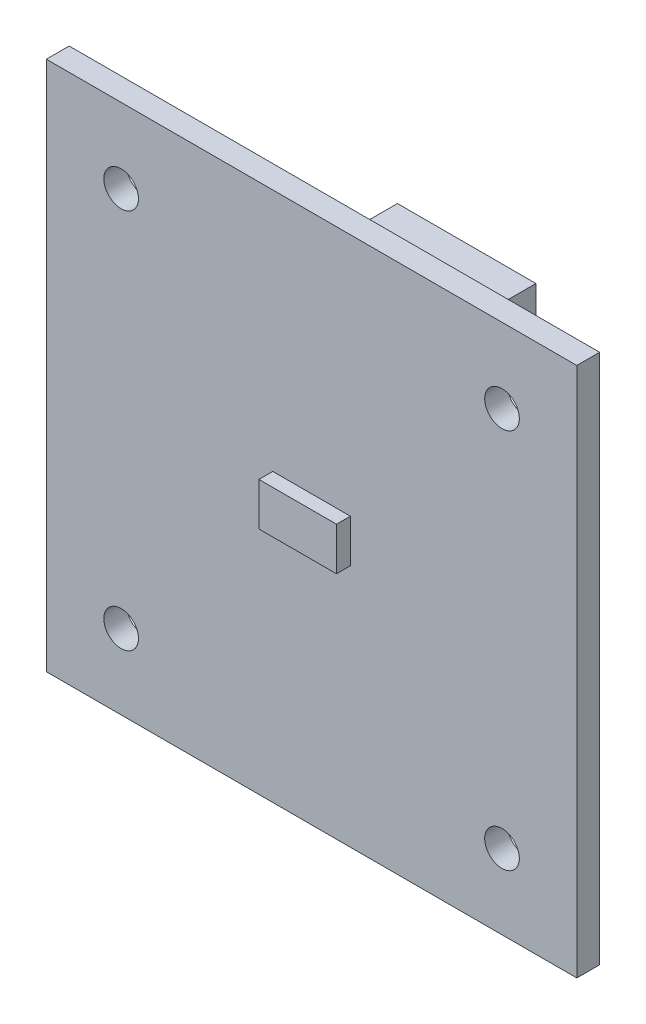
ISO-10303-21;
HEADER;
FILE_DESCRIPTION(('STEP AP214'),'2;1');
FILE_NAME('part.step','',(''),(''),'','','');
FILE_SCHEMA(('AUTOMOTIVE_DESIGN { 1 0 10303 214 1 1 1 1 }'));
ENDSEC;
DATA;
#1=APPLICATION_CONTEXT('core data for automotive mechanical design processes');
#2=APPLICATION_PROTOCOL_DEFINITION('international standard','automotive_design',2000,#1);
#3=PRODUCT_CONTEXT('',#1,'mechanical');
#4=PRODUCT('Part','Part','',(#3));
#5=PRODUCT_RELATED_PRODUCT_CATEGORY('part','',(#4));
#6=PRODUCT_DEFINITION_FORMATION('','',#4);
#7=PRODUCT_DEFINITION_CONTEXT('part definition',#1,'design');
#8=PRODUCT_DEFINITION('design','',#6,#7);
#9=PRODUCT_DEFINITION_SHAPE('','',#8);
#10=(LENGTH_UNIT() NAMED_UNIT(*) SI_UNIT(.MILLI.,.METRE.));
#11=(NAMED_UNIT(*) PLANE_ANGLE_UNIT() SI_UNIT($,.RADIAN.));
#12=(NAMED_UNIT(*) SI_UNIT($,.STERADIAN.) SOLID_ANGLE_UNIT());
#13=UNCERTAINTY_MEASURE_WITH_UNIT(LENGTH_MEASURE(1.E-05),#10,'distance_accuracy_value','');
#14=(GEOMETRIC_REPRESENTATION_CONTEXT(3) GLOBAL_UNCERTAINTY_ASSIGNED_CONTEXT((#13)) GLOBAL_UNIT_ASSIGNED_CONTEXT((#10,
#11,#12)) REPRESENTATION_CONTEXT('',''));
#15=CARTESIAN_POINT('',(0.,0.,0.));
#16=DIRECTION('',(0.,0.,1.));
#17=DIRECTION('',(1.,0.,0.));
#18=AXIS2_PLACEMENT_3D('',#15,#16,#17);
#19=CARTESIAN_POINT('',(0.,0.,0.));
#20=DIRECTION('',(0.,0.,-1.));
#21=DIRECTION('',(-1.,0.,0.));
#22=AXIS2_PLACEMENT_3D('',#19,#20,#21);
#23=PLANE('',#22);
#24=CARTESIAN_POINT('',(13.75,-13.75,0.));
#25=DIRECTION('',(0.,0.,1.));
#26=DIRECTION('',(1.,0.,0.));
#27=AXIS2_PLACEMENT_3D('',#24,#25,#26);
#28=CIRCLE('',#27,1.25);
#29=CARTESIAN_POINT('',(15.,-13.75,0.));
#30=VERTEX_POINT('',#29);
#31=EDGE_CURVE('E197',#30,#30,#28,.T.);
#32=ORIENTED_EDGE('',*,*,#31,.T.);
#33=EDGE_LOOP('',(#32));
#34=FACE_BOUND('',#33,.T.);
#35=CARTESIAN_POINT('',(-13.75,13.75,0.));
#36=DIRECTION('',(0.,0.,1.));
#37=DIRECTION('',(1.,0.,0.));
#38=AXIS2_PLACEMENT_3D('',#35,#36,#37);
#39=CIRCLE('',#38,1.25);
#40=CARTESIAN_POINT('',(-12.5,13.75,0.));
#41=VERTEX_POINT('',#40);
#42=EDGE_CURVE('E209',#41,#41,#39,.T.);
#43=ORIENTED_EDGE('',*,*,#42,.T.);
#44=EDGE_LOOP('',(#43));
#45=FACE_BOUND('',#44,.T.);
#46=DIRECTION('',(0.,1.,0.));
#47=VECTOR('',#46,1.);
#48=CARTESIAN_POINT('',(19.15,-19.15,0.));
#49=LINE('',#48,#47);
#50=CARTESIAN_POINT('',(19.15,-19.15,0.));
#51=VERTEX_POINT('',#50);
#52=CARTESIAN_POINT('',(19.15,19.15,0.));
#53=VERTEX_POINT('',#52);
#54=EDGE_CURVE('E215',#51,#53,#49,.T.);
#55=ORIENTED_EDGE('',*,*,#54,.F.);
#56=DIRECTION('',(1.,0.,0.));
#57=VECTOR('',#56,1.);
#58=CARTESIAN_POINT('',(-19.15,-19.15,0.));
#59=LINE('',#58,#57);
#60=CARTESIAN_POINT('',(-19.15,-19.15,0.));
#61=VERTEX_POINT('',#60);
#62=EDGE_CURVE('E222',#61,#51,#59,.T.);
#63=ORIENTED_EDGE('',*,*,#62,.F.);
#64=DIRECTION('',(0.,-1.,0.));
#65=VECTOR('',#64,1.);
#66=CARTESIAN_POINT('',(-19.15,-19.15,0.));
#67=LINE('',#66,#65);
#68=CARTESIAN_POINT('',(-19.15,19.15,0.));
#69=VERTEX_POINT('',#68);
#70=EDGE_CURVE('E237',#69,#61,#67,.T.);
#71=ORIENTED_EDGE('',*,*,#70,.F.);
#72=DIRECTION('',(-1.,0.,0.));
#73=VECTOR('',#72,1.);
#74=CARTESIAN_POINT('',(-19.15,19.15,0.));
#75=LINE('',#74,#73);
#76=EDGE_CURVE('E234',#53,#69,#75,.T.);
#77=ORIENTED_EDGE('',*,*,#76,.F.);
#78=EDGE_LOOP('',(#55,#63,#71,#77));
#79=FACE_BOUND('',#78,.T.);
#80=CARTESIAN_POINT('',(13.75,13.75,0.));
#81=DIRECTION('',(0.,0.,1.));
#82=DIRECTION('',(1.,0.,0.));
#83=AXIS2_PLACEMENT_3D('',#80,#81,#82);
#84=CIRCLE('',#83,1.25);
#85=CARTESIAN_POINT('',(15.,13.75,0.));
#86=VERTEX_POINT('',#85);
#87=EDGE_CURVE('E203',#86,#86,#84,.T.);
#88=ORIENTED_EDGE('',*,*,#87,.T.);
#89=EDGE_LOOP('',(#88));
#90=FACE_BOUND('',#89,.T.);
#91=CARTESIAN_POINT('',(-13.75,-13.75,0.));
#92=DIRECTION('',(0.,0.,1.));
#93=DIRECTION('',(1.,0.,0.));
#94=AXIS2_PLACEMENT_3D('',#91,#92,#93);
#95=CIRCLE('',#94,1.25);
#96=CARTESIAN_POINT('',(-12.5,-13.75,0.));
#97=VERTEX_POINT('',#96);
#98=EDGE_CURVE('E193',#97,#97,#95,.T.);
#99=ORIENTED_EDGE('',*,*,#98,.T.);
#100=EDGE_LOOP('',(#99));
#101=FACE_BOUND('',#100,.T.);
#102=DIRECTION('',(-1.,0.,0.));
#103=VECTOR('',#102,1.);
#104=CARTESIAN_POINT('',(8.54999999999999,10.45,0.));
#105=LINE('',#104,#103);
#106=CARTESIAN_POINT('',(8.54999999999999,10.45,0.));
#107=VERTEX_POINT('',#106);
#108=CARTESIAN_POINT('',(-1.45000000000001,10.45,0.));
#109=VERTEX_POINT('',#108);
#110=EDGE_CURVE('E541',#107,#109,#105,.T.);
#111=ORIENTED_EDGE('',*,*,#110,.F.);
#112=DIRECTION('',(0.,-1.,0.));
#113=VECTOR('',#112,1.);
#114=CARTESIAN_POINT('',(8.54999999999999,10.45,0.));
#115=LINE('',#114,#113);
#116=CARTESIAN_POINT('',(8.54999999999999,15.15,0.));
#117=VERTEX_POINT('',#116);
#118=EDGE_CURVE('E152',#117,#107,#115,.T.);
#119=ORIENTED_EDGE('',*,*,#118,.F.);
#120=DIRECTION('',(1.,0.,0.));
#121=VECTOR('',#120,1.);
#122=CARTESIAN_POINT('',(8.54999999999999,15.15,0.));
#123=LINE('',#122,#121);
#124=CARTESIAN_POINT('',(-1.45000000000001,15.15,0.));
#125=VERTEX_POINT('',#124);
#126=EDGE_CURVE('E148',#125,#117,#123,.T.);
#127=ORIENTED_EDGE('',*,*,#126,.F.);
#128=DIRECTION('',(0.,1.,0.));
#129=VECTOR('',#128,1.);
#130=CARTESIAN_POINT('',(-1.45000000000001,10.45,0.));
#131=LINE('',#130,#129);
#132=EDGE_CURVE('E538',#109,#125,#131,.T.);
#133=ORIENTED_EDGE('',*,*,#132,.F.);
#134=EDGE_LOOP('',(#111,#119,#127,#133));
#135=FACE_BOUND('',#134,.T.);
#136=ADVANCED_FACE('F40',(#34,#45,#79,#90,#101,#135),#23,.T.);
#137=CARTESIAN_POINT('',(0.,0.,1.65));
#138=DIRECTION('',(0.,0.,-1.));
#139=DIRECTION('',(-1.,0.,0.));
#140=AXIS2_PLACEMENT_3D('',#137,#138,#139);
#141=PLANE('',#140);
#142=CARTESIAN_POINT('',(-13.75,-13.75,1.65));
#143=DIRECTION('',(0.,0.,1.));
#144=DIRECTION('',(1.,0.,0.));
#145=AXIS2_PLACEMENT_3D('',#142,#143,#144);
#146=CIRCLE('',#145,1.25);
#147=CARTESIAN_POINT('',(-12.5,-13.75,1.65));
#148=VERTEX_POINT('',#147);
#149=EDGE_CURVE('E194',#148,#148,#146,.T.);
#150=ORIENTED_EDGE('',*,*,#149,.F.);
#151=EDGE_LOOP('',(#150));
#152=FACE_BOUND('',#151,.T.);
#153=CARTESIAN_POINT('',(13.75,-13.75,1.65));
#154=DIRECTION('',(0.,0.,1.));
#155=DIRECTION('',(1.,0.,0.));
#156=AXIS2_PLACEMENT_3D('',#153,#154,#155);
#157=CIRCLE('',#156,1.25);
#158=CARTESIAN_POINT('',(15.,-13.75,1.65));
#159=VERTEX_POINT('',#158);
#160=EDGE_CURVE('E200',#159,#159,#157,.T.);
#161=ORIENTED_EDGE('',*,*,#160,.F.);
#162=EDGE_LOOP('',(#161));
#163=FACE_BOUND('',#162,.T.);
#164=CARTESIAN_POINT('',(13.75,13.75,1.65));
#165=DIRECTION('',(0.,0.,1.));
#166=DIRECTION('',(1.,0.,0.));
#167=AXIS2_PLACEMENT_3D('',#164,#165,#166);
#168=CIRCLE('',#167,1.25);
#169=CARTESIAN_POINT('',(15.,13.75,1.65));
#170=VERTEX_POINT('',#169);
#171=EDGE_CURVE('E206',#170,#170,#168,.T.);
#172=ORIENTED_EDGE('',*,*,#171,.F.);
#173=EDGE_LOOP('',(#172));
#174=FACE_BOUND('',#173,.T.);
#175=CARTESIAN_POINT('',(-13.75,13.75,1.65));
#176=DIRECTION('',(0.,0.,1.));
#177=DIRECTION('',(1.,0.,0.));
#178=AXIS2_PLACEMENT_3D('',#175,#176,#177);
#179=CIRCLE('',#178,1.25);
#180=CARTESIAN_POINT('',(-12.5,13.75,1.65));
#181=VERTEX_POINT('',#180);
#182=EDGE_CURVE('E212',#181,#181,#179,.T.);
#183=ORIENTED_EDGE('',*,*,#182,.F.);
#184=EDGE_LOOP('',(#183));
#185=FACE_BOUND('',#184,.T.);
#186=DIRECTION('',(0.,1.,0.));
#187=VECTOR('',#186,1.);
#188=CARTESIAN_POINT('',(19.15,-19.15,1.65));
#189=LINE('',#188,#187);
#190=CARTESIAN_POINT('',(19.15,-19.15,1.65));
#191=VERTEX_POINT('',#190);
#192=CARTESIAN_POINT('',(19.15,19.15,1.65));
#193=VERTEX_POINT('',#192);
#194=EDGE_CURVE('E218',#191,#193,#189,.T.);
#195=ORIENTED_EDGE('',*,*,#194,.T.);
#196=DIRECTION('',(-1.,0.,0.));
#197=VECTOR('',#196,1.);
#198=CARTESIAN_POINT('',(-19.15,19.15,1.65));
#199=LINE('',#198,#197);
#200=CARTESIAN_POINT('',(-19.15,19.15,1.65));
#201=VERTEX_POINT('',#200);
#202=EDGE_CURVE('E221',#193,#201,#199,.T.);
#203=ORIENTED_EDGE('',*,*,#202,.T.);
#204=DIRECTION('',(0.,-1.,0.));
#205=VECTOR('',#204,1.);
#206=CARTESIAN_POINT('',(-19.15,-19.15,1.65));
#207=LINE('',#206,#205);
#208=CARTESIAN_POINT('',(-19.15,-19.15,1.65));
#209=VERTEX_POINT('',#208);
#210=EDGE_CURVE('E224',#201,#209,#207,.T.);
#211=ORIENTED_EDGE('',*,*,#210,.T.);
#212=DIRECTION('',(1.,0.,0.));
#213=VECTOR('',#212,1.);
#214=CARTESIAN_POINT('',(-19.15,-19.15,1.65));
#215=LINE('',#214,#213);
#216=EDGE_CURVE('E227',#209,#191,#215,.T.);
#217=ORIENTED_EDGE('',*,*,#216,.T.);
#218=EDGE_LOOP('',(#195,#203,#211,#217));
#219=FACE_BOUND('',#218,.T.);
#220=DIRECTION('',(0.,1.,0.));
#221=VECTOR('',#220,1.);
#222=CARTESIAN_POINT('',(2.8,-1.55,1.65));
#223=LINE('',#222,#221);
#224=CARTESIAN_POINT('',(2.8,-1.55,1.65));
#225=VERTEX_POINT('',#224);
#226=CARTESIAN_POINT('',(2.8,1.55,1.65));
#227=VERTEX_POINT('',#226);
#228=EDGE_CURVE('E154',#225,#227,#223,.T.);
#229=ORIENTED_EDGE('',*,*,#228,.F.);
#230=DIRECTION('',(1.,0.,0.));
#231=VECTOR('',#230,1.);
#232=CARTESIAN_POINT('',(-2.8,-1.55,1.65));
#233=LINE('',#232,#231);
#234=CARTESIAN_POINT('',(-2.8,-1.55,1.65));
#235=VERTEX_POINT('',#234);
#236=EDGE_CURVE('E167',#235,#225,#233,.T.);
#237=ORIENTED_EDGE('',*,*,#236,.F.);
#238=DIRECTION('',(0.,-1.,0.));
#239=VECTOR('',#238,1.);
#240=CARTESIAN_POINT('',(-2.8,-1.55,1.65));
#241=LINE('',#240,#239);
#242=CARTESIAN_POINT('',(-2.8,1.55,1.65));
#243=VERTEX_POINT('',#242);
#244=EDGE_CURVE('E177',#243,#235,#241,.T.);
#245=ORIENTED_EDGE('',*,*,#244,.F.);
#246=DIRECTION('',(-1.,0.,0.));
#247=VECTOR('',#246,1.);
#248=CARTESIAN_POINT('',(-2.8,1.55,1.65));
#249=LINE('',#248,#247);
#250=EDGE_CURVE('E63',#227,#243,#249,.T.);
#251=ORIENTED_EDGE('',*,*,#250,.F.);
#252=EDGE_LOOP('',(#229,#237,#245,#251));
#253=FACE_BOUND('',#252,.T.);
#254=ADVANCED_FACE('F266',(#152,#163,#174,#185,#219,#253),#141,.F.);
#255=CARTESIAN_POINT('',(19.15,-19.15,1.65));
#256=DIRECTION('',(-1.,0.,0.));
#257=DIRECTION('',(0.,0.,1.));
#258=AXIS2_PLACEMENT_3D('',#255,#256,#257);
#259=PLANE('',#258);
#260=ORIENTED_EDGE('',*,*,#54,.T.);
#261=DIRECTION('',(0.,0.,-1.));
#262=VECTOR('',#261,1.);
#263=CARTESIAN_POINT('',(19.15,19.15,1.65));
#264=LINE('',#263,#262);
#265=EDGE_CURVE('E11',#193,#53,#264,.T.);
#266=ORIENTED_EDGE('',*,*,#265,.F.);
#267=ORIENTED_EDGE('',*,*,#194,.F.);
#268=DIRECTION('',(0.,0.,-1.));
#269=VECTOR('',#268,1.);
#270=CARTESIAN_POINT('',(19.15,-19.15,1.65));
#271=LINE('',#270,#269);
#272=EDGE_CURVE('E230',#191,#51,#271,.T.);
#273=ORIENTED_EDGE('',*,*,#272,.T.);
#274=EDGE_LOOP('',(#260,#266,#267,#273));
#275=FACE_BOUND('',#274,.T.);
#276=ADVANCED_FACE('F42',(#275),#259,.F.);
#277=CARTESIAN_POINT('',(-19.15,19.15,1.65));
#278=DIRECTION('',(0.,-1.,0.));
#279=DIRECTION('',(0.,0.,-1.));
#280=AXIS2_PLACEMENT_3D('',#277,#278,#279);
#281=PLANE('',#280);
#282=ORIENTED_EDGE('',*,*,#76,.T.);
#283=DIRECTION('',(0.,0.,-1.));
#284=VECTOR('',#283,1.);
#285=CARTESIAN_POINT('',(-19.15,19.15,1.65));
#286=LINE('',#285,#284);
#287=EDGE_CURVE('E48',#201,#69,#286,.T.);
#288=ORIENTED_EDGE('',*,*,#287,.F.);
#289=ORIENTED_EDGE('',*,*,#202,.F.);
#290=ORIENTED_EDGE('',*,*,#265,.T.);
#291=EDGE_LOOP('',(#282,#288,#289,#290));
#292=FACE_BOUND('',#291,.T.);
#293=ADVANCED_FACE('F267',(#292),#281,.F.);
#294=CARTESIAN_POINT('',(-19.15,-19.15,1.65));
#295=DIRECTION('',(1.,0.,0.));
#296=DIRECTION('',(0.,0.,-1.));
#297=AXIS2_PLACEMENT_3D('',#294,#295,#296);
#298=PLANE('',#297);
#299=ORIENTED_EDGE('',*,*,#70,.T.);
#300=DIRECTION('',(0.,0.,-1.));
#301=VECTOR('',#300,1.);
#302=CARTESIAN_POINT('',(-19.15,-19.15,1.65));
#303=LINE('',#302,#301);
#304=EDGE_CURVE('E244',#209,#61,#303,.T.);
#305=ORIENTED_EDGE('',*,*,#304,.F.);
#306=ORIENTED_EDGE('',*,*,#210,.F.);
#307=ORIENTED_EDGE('',*,*,#287,.T.);
#308=EDGE_LOOP('',(#299,#305,#306,#307));
#309=FACE_BOUND('',#308,.T.);
#310=ADVANCED_FACE('F251',(#309),#298,.F.);
#311=CARTESIAN_POINT('',(-19.15,-19.15,1.65));
#312=DIRECTION('',(0.,1.,0.));
#313=DIRECTION('',(0.,0.,1.));
#314=AXIS2_PLACEMENT_3D('',#311,#312,#313);
#315=PLANE('',#314);
#316=ORIENTED_EDGE('',*,*,#62,.T.);
#317=ORIENTED_EDGE('',*,*,#272,.F.);
#318=ORIENTED_EDGE('',*,*,#216,.F.);
#319=ORIENTED_EDGE('',*,*,#304,.T.);
#320=EDGE_LOOP('',(#316,#317,#318,#319));
#321=FACE_BOUND('',#320,.T.);
#322=ADVANCED_FACE('F260',(#321),#315,.F.);
#323=CARTESIAN_POINT('',(-13.75,13.75,1.65));
#324=DIRECTION('',(0.,0.,-1.));
#325=DIRECTION('',(-1.,0.,0.));
#326=AXIS2_PLACEMENT_3D('',#323,#324,#325);
#327=CYLINDRICAL_SURFACE('',#326,1.25);
#328=ORIENTED_EDGE('',*,*,#182,.T.);
#329=EDGE_LOOP('',(#328));
#330=FACE_BOUND('',#329,.T.);
#331=ORIENTED_EDGE('',*,*,#42,.F.);
#332=EDGE_LOOP('',(#331));
#333=FACE_BOUND('',#332,.T.);
#334=ADVANCED_FACE('F286',(#330,#333),#327,.F.);
#335=CARTESIAN_POINT('',(13.75,13.75,1.65));
#336=DIRECTION('',(0.,0.,-1.));
#337=DIRECTION('',(-1.,0.,0.));
#338=AXIS2_PLACEMENT_3D('',#335,#336,#337);
#339=CYLINDRICAL_SURFACE('',#338,1.25);
#340=ORIENTED_EDGE('',*,*,#171,.T.);
#341=EDGE_LOOP('',(#340));
#342=FACE_BOUND('',#341,.T.);
#343=ORIENTED_EDGE('',*,*,#87,.F.);
#344=EDGE_LOOP('',(#343));
#345=FACE_BOUND('',#344,.T.);
#346=ADVANCED_FACE('F290',(#342,#345),#339,.F.);
#347=CARTESIAN_POINT('',(13.75,-13.75,1.65));
#348=DIRECTION('',(0.,0.,-1.));
#349=DIRECTION('',(-1.,0.,0.));
#350=AXIS2_PLACEMENT_3D('',#347,#348,#349);
#351=CYLINDRICAL_SURFACE('',#350,1.25);
#352=ORIENTED_EDGE('',*,*,#160,.T.);
#353=EDGE_LOOP('',(#352));
#354=FACE_BOUND('',#353,.T.);
#355=ORIENTED_EDGE('',*,*,#31,.F.);
#356=EDGE_LOOP('',(#355));
#357=FACE_BOUND('',#356,.T.);
#358=ADVANCED_FACE('F295',(#354,#357),#351,.F.);
#359=CARTESIAN_POINT('',(-13.75,-13.75,1.65));
#360=DIRECTION('',(0.,0.,-1.));
#361=DIRECTION('',(-1.,0.,0.));
#362=AXIS2_PLACEMENT_3D('',#359,#360,#361);
#363=CYLINDRICAL_SURFACE('',#362,1.25);
#364=ORIENTED_EDGE('',*,*,#149,.T.);
#365=EDGE_LOOP('',(#364));
#366=FACE_BOUND('',#365,.T.);
#367=ORIENTED_EDGE('',*,*,#98,.F.);
#368=EDGE_LOOP('',(#367));
#369=FACE_BOUND('',#368,.T.);
#370=ADVANCED_FACE('F302',(#366,#369),#363,.F.);
#371=CARTESIAN_POINT('',(2.8,-1.55,2.65));
#372=DIRECTION('',(-1.,0.,0.));
#373=DIRECTION('',(0.,0.,1.));
#374=AXIS2_PLACEMENT_3D('',#371,#372,#373);
#375=PLANE('',#374);
#376=ORIENTED_EDGE('',*,*,#228,.T.);
#377=DIRECTION('',(0.,0.,-1.));
#378=VECTOR('',#377,1.);
#379=CARTESIAN_POINT('',(2.8,1.55,2.65));
#380=LINE('',#379,#378);
#381=CARTESIAN_POINT('',(2.8,1.55,2.65));
#382=VERTEX_POINT('',#381);
#383=EDGE_CURVE('E191',#382,#227,#380,.T.);
#384=ORIENTED_EDGE('',*,*,#383,.F.);
#385=DIRECTION('',(0.,1.,0.));
#386=VECTOR('',#385,1.);
#387=CARTESIAN_POINT('',(2.8,-1.55,2.65));
#388=LINE('',#387,#386);
#389=CARTESIAN_POINT('',(2.8,-1.55,2.65));
#390=VERTEX_POINT('',#389);
#391=EDGE_CURVE('E162',#390,#382,#388,.T.);
#392=ORIENTED_EDGE('',*,*,#391,.F.);
#393=DIRECTION('',(0.,0.,-1.));
#394=VECTOR('',#393,1.);
#395=CARTESIAN_POINT('',(2.8,-1.55,2.65));
#396=LINE('',#395,#394);
#397=EDGE_CURVE('E173',#390,#225,#396,.T.);
#398=ORIENTED_EDGE('',*,*,#397,.T.);
#399=EDGE_LOOP('',(#376,#384,#392,#398));
#400=FACE_BOUND('',#399,.T.);
#401=ADVANCED_FACE('F306',(#400),#375,.F.);
#402=CARTESIAN_POINT('',(-2.8,1.55,2.65));
#403=DIRECTION('',(0.,-1.,0.));
#404=DIRECTION('',(0.,0.,-1.));
#405=AXIS2_PLACEMENT_3D('',#402,#403,#404);
#406=PLANE('',#405);
#407=ORIENTED_EDGE('',*,*,#250,.T.);
#408=DIRECTION('',(0.,0.,-1.));
#409=VECTOR('',#408,1.);
#410=CARTESIAN_POINT('',(-2.8,1.55,2.65));
#411=LINE('',#410,#409);
#412=CARTESIAN_POINT('',(-2.8,1.55,2.65));
#413=VERTEX_POINT('',#412);
#414=EDGE_CURVE('E188',#413,#243,#411,.T.);
#415=ORIENTED_EDGE('',*,*,#414,.F.);
#416=DIRECTION('',(-1.,0.,0.));
#417=VECTOR('',#416,1.);
#418=CARTESIAN_POINT('',(-2.8,1.55,2.65));
#419=LINE('',#418,#417);
#420=EDGE_CURVE('E166',#382,#413,#419,.T.);
#421=ORIENTED_EDGE('',*,*,#420,.F.);
#422=ORIENTED_EDGE('',*,*,#383,.T.);
#423=EDGE_LOOP('',(#407,#415,#421,#422));
#424=FACE_BOUND('',#423,.T.);
#425=ADVANCED_FACE('F310',(#424),#406,.F.);
#426=CARTESIAN_POINT('',(-2.8,-1.55,2.65));
#427=DIRECTION('',(1.,0.,0.));
#428=DIRECTION('',(0.,0.,-1.));
#429=AXIS2_PLACEMENT_3D('',#426,#427,#428);
#430=PLANE('',#429);
#431=ORIENTED_EDGE('',*,*,#244,.T.);
#432=DIRECTION('',(0.,0.,-1.));
#433=VECTOR('',#432,1.);
#434=CARTESIAN_POINT('',(-2.8,-1.55,2.65));
#435=LINE('',#434,#433);
#436=CARTESIAN_POINT('',(-2.8,-1.55,2.65));
#437=VERTEX_POINT('',#436);
#438=EDGE_CURVE('E185',#437,#235,#435,.T.);
#439=ORIENTED_EDGE('',*,*,#438,.F.);
#440=DIRECTION('',(0.,-1.,0.));
#441=VECTOR('',#440,1.);
#442=CARTESIAN_POINT('',(-2.8,-1.55,2.65));
#443=LINE('',#442,#441);
#444=EDGE_CURVE('E169',#413,#437,#443,.T.);
#445=ORIENTED_EDGE('',*,*,#444,.F.);
#446=ORIENTED_EDGE('',*,*,#414,.T.);
#447=EDGE_LOOP('',(#431,#439,#445,#446));
#448=FACE_BOUND('',#447,.T.);
#449=ADVANCED_FACE('F314',(#448),#430,.F.);
#450=CARTESIAN_POINT('',(-2.8,-1.55,2.65));
#451=DIRECTION('',(0.,1.,0.));
#452=DIRECTION('',(0.,0.,1.));
#453=AXIS2_PLACEMENT_3D('',#450,#451,#452);
#454=PLANE('',#453);
#455=ORIENTED_EDGE('',*,*,#236,.T.);
#456=ORIENTED_EDGE('',*,*,#397,.F.);
#457=DIRECTION('',(1.,0.,0.));
#458=VECTOR('',#457,1.);
#459=CARTESIAN_POINT('',(-2.8,-1.55,2.65));
#460=LINE('',#459,#458);
#461=EDGE_CURVE('E172',#437,#390,#460,.T.);
#462=ORIENTED_EDGE('',*,*,#461,.F.);
#463=ORIENTED_EDGE('',*,*,#438,.T.);
#464=EDGE_LOOP('',(#455,#456,#462,#463));
#465=FACE_BOUND('',#464,.T.);
#466=ADVANCED_FACE('F318',(#465),#454,.F.);
#467=CARTESIAN_POINT('',(0.,0.,2.65));
#468=DIRECTION('',(0.,0.,-1.));
#469=DIRECTION('',(-1.,0.,0.));
#470=AXIS2_PLACEMENT_3D('',#467,#468,#469);
#471=PLANE('',#470);
#472=ORIENTED_EDGE('',*,*,#391,.T.);
#473=ORIENTED_EDGE('',*,*,#420,.T.);
#474=ORIENTED_EDGE('',*,*,#444,.T.);
#475=ORIENTED_EDGE('',*,*,#461,.T.);
#476=EDGE_LOOP('',(#472,#473,#474,#475));
#477=FACE_BOUND('',#476,.T.);
#478=ADVANCED_FACE('F322',(#477),#471,.F.);
#479=CARTESIAN_POINT('',(8.54999999999999,10.45,-6.));
#480=DIRECTION('',(-1.,0.,0.));
#481=DIRECTION('',(0.,0.,1.));
#482=AXIS2_PLACEMENT_3D('',#479,#480,#481);
#483=PLANE('',#482);
#484=ORIENTED_EDGE('',*,*,#118,.T.);
#485=DIRECTION('',(0.,0.,1.));
#486=VECTOR('',#485,1.);
#487=CARTESIAN_POINT('',(8.54999999999999,10.45,-6.));
#488=LINE('',#487,#486);
#489=CARTESIAN_POINT('',(8.54999999999999,10.45,-6.));
#490=VERTEX_POINT('',#489);
#491=EDGE_CURVE('E133',#490,#107,#488,.T.);
#492=ORIENTED_EDGE('',*,*,#491,.F.);
#493=DIRECTION('',(0.,-1.,0.));
#494=VECTOR('',#493,1.);
#495=CARTESIAN_POINT('',(8.54999999999999,10.45,-6.));
#496=LINE('',#495,#494);
#497=CARTESIAN_POINT('',(8.54999999999999,15.15,-6.));
#498=VERTEX_POINT('',#497);
#499=EDGE_CURVE('E140',#498,#490,#496,.T.);
#500=ORIENTED_EDGE('',*,*,#499,.F.);
#501=DIRECTION('',(0.,0.,1.));
#502=VECTOR('',#501,1.);
#503=CARTESIAN_POINT('',(8.54999999999999,15.15,-6.));
#504=LINE('',#503,#502);
#505=EDGE_CURVE('E535',#498,#117,#504,.T.);
#506=ORIENTED_EDGE('',*,*,#505,.T.);
#507=EDGE_LOOP('',(#484,#492,#500,#506));
#508=FACE_BOUND('',#507,.T.);
#509=ADVANCED_FACE('F150',(#508),#483,.F.);
#510=CARTESIAN_POINT('',(8.54999999999999,10.45,-6.));
#511=DIRECTION('',(0.,1.,0.));
#512=DIRECTION('',(-1.,0.,0.));
#513=AXIS2_PLACEMENT_3D('',#510,#511,#512);
#514=PLANE('',#513);
#515=ORIENTED_EDGE('',*,*,#110,.T.);
#516=DIRECTION('',(0.,0.,1.));
#517=VECTOR('',#516,1.);
#518=CARTESIAN_POINT('',(-1.45000000000001,10.45,-6.));
#519=LINE('',#518,#517);
#520=CARTESIAN_POINT('',(-1.45000000000001,10.45,-6.));
#521=VERTEX_POINT('',#520);
#522=EDGE_CURVE('E136',#521,#109,#519,.T.);
#523=ORIENTED_EDGE('',*,*,#522,.F.);
#524=DIRECTION('',(-1.,0.,0.));
#525=VECTOR('',#524,1.);
#526=CARTESIAN_POINT('',(8.54999999999999,10.45,-6.));
#527=LINE('',#526,#525);
#528=EDGE_CURVE('E129',#490,#521,#527,.T.);
#529=ORIENTED_EDGE('',*,*,#528,.F.);
#530=ORIENTED_EDGE('',*,*,#491,.T.);
#531=EDGE_LOOP('',(#515,#523,#529,#530));
#532=FACE_BOUND('',#531,.T.);
#533=ADVANCED_FACE('F131',(#532),#514,.F.);
#534=CARTESIAN_POINT('',(-1.45000000000001,10.45,-6.));
#535=DIRECTION('',(1.,0.,0.));
#536=DIRECTION('',(0.,0.,-1.));
#537=AXIS2_PLACEMENT_3D('',#534,#535,#536);
#538=PLANE('',#537);
#539=ORIENTED_EDGE('',*,*,#132,.T.);
#540=DIRECTION('',(0.,0.,1.));
#541=VECTOR('',#540,1.);
#542=CARTESIAN_POINT('',(-1.45000000000001,15.15,-6.));
#543=LINE('',#542,#541);
#544=CARTESIAN_POINT('',(-1.45000000000001,15.15,-6.));
#545=VERTEX_POINT('',#544);
#546=EDGE_CURVE('E55',#545,#125,#543,.T.);
#547=ORIENTED_EDGE('',*,*,#546,.F.);
#548=DIRECTION('',(0.,1.,0.));
#549=VECTOR('',#548,1.);
#550=CARTESIAN_POINT('',(-1.45000000000001,10.45,-6.));
#551=LINE('',#550,#549);
#552=EDGE_CURVE('E139',#521,#545,#551,.T.);
#553=ORIENTED_EDGE('',*,*,#552,.F.);
#554=ORIENTED_EDGE('',*,*,#522,.T.);
#555=EDGE_LOOP('',(#539,#547,#553,#554));
#556=FACE_BOUND('',#555,.T.);
#557=ADVANCED_FACE('F331',(#556),#538,.F.);
#558=CARTESIAN_POINT('',(8.54999999999999,15.15,-6.));
#559=DIRECTION('',(0.,-1.,0.));
#560=DIRECTION('',(0.,0.,-1.));
#561=AXIS2_PLACEMENT_3D('',#558,#559,#560);
#562=PLANE('',#561);
#563=ORIENTED_EDGE('',*,*,#126,.T.);
#564=ORIENTED_EDGE('',*,*,#505,.F.);
#565=DIRECTION('',(1.,0.,0.));
#566=VECTOR('',#565,1.);
#567=CARTESIAN_POINT('',(8.54999999999999,15.15,-6.));
#568=LINE('',#567,#566);
#569=EDGE_CURVE('E144',#545,#498,#568,.T.);
#570=ORIENTED_EDGE('',*,*,#569,.F.);
#571=ORIENTED_EDGE('',*,*,#546,.T.);
#572=EDGE_LOOP('',(#563,#564,#570,#571));
#573=FACE_BOUND('',#572,.T.);
#574=ADVANCED_FACE('F334',(#573),#562,.F.);
#575=CARTESIAN_POINT('',(0.,0.,-6.));
#576=DIRECTION('',(0.,0.,1.));
#577=DIRECTION('',(1.,0.,0.));
#578=AXIS2_PLACEMENT_3D('',#575,#576,#577);
#579=PLANE('',#578);
#580=ORIENTED_EDGE('',*,*,#499,.T.);
#581=ORIENTED_EDGE('',*,*,#528,.T.);
#582=ORIENTED_EDGE('',*,*,#552,.T.);
#583=ORIENTED_EDGE('',*,*,#569,.T.);
#584=EDGE_LOOP('',(#580,#581,#582,#583));
#585=FACE_BOUND('',#584,.T.);
#586=ADVANCED_FACE('F143',(#585),#579,.F.);
#587=CLOSED_SHELL('',(#136,#254,#276,#293,#310,#322,#334,#346,#358,#370,#401,#425,#449,#466,
#478,#509,#533,#557,#574,#586));
#588=MANIFOLD_SOLID_BREP('B2',#587);
#589=ADVANCED_BREP_SHAPE_REPRESENTATION('',(#18,#588),#14);
#590=SHAPE_DEFINITION_REPRESENTATION(#9,#589);
ENDSEC;
END-ISO-10303-21;
